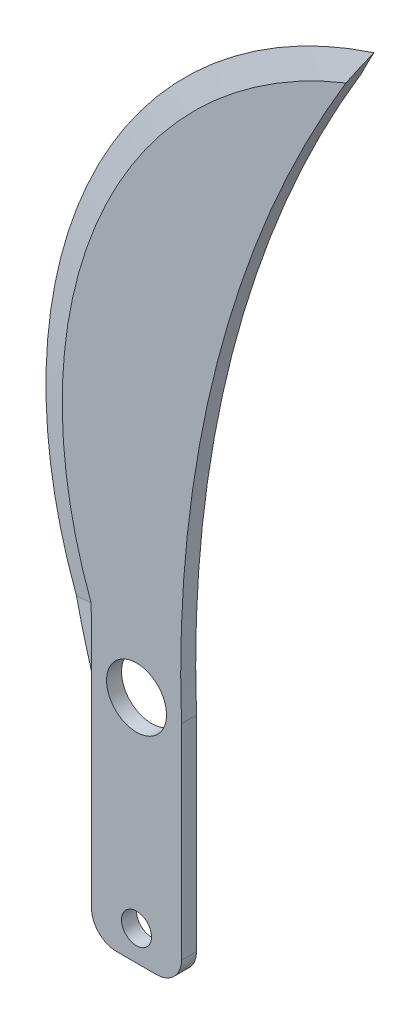
ISO-10303-21;
HEADER;
FILE_DESCRIPTION(('STEP AP214'),'2;1');
FILE_NAME('part.step','',(''),(''),'','','');
FILE_SCHEMA(('AUTOMOTIVE_DESIGN { 1 0 10303 214 1 1 1 1 }'));
ENDSEC;
DATA;
#1=APPLICATION_CONTEXT('core data for automotive mechanical design processes');
#2=APPLICATION_PROTOCOL_DEFINITION('international standard','automotive_design',2000,#1);
#3=PRODUCT_CONTEXT('',#1,'mechanical');
#4=PRODUCT('Part','Part','',(#3));
#5=PRODUCT_RELATED_PRODUCT_CATEGORY('part','',(#4));
#6=PRODUCT_DEFINITION_FORMATION('','',#4);
#7=PRODUCT_DEFINITION_CONTEXT('part definition',#1,'design');
#8=PRODUCT_DEFINITION('design','',#6,#7);
#9=PRODUCT_DEFINITION_SHAPE('','',#8);
#10=(LENGTH_UNIT() NAMED_UNIT(*) SI_UNIT(.MILLI.,.METRE.));
#11=(NAMED_UNIT(*) PLANE_ANGLE_UNIT() SI_UNIT($,.RADIAN.));
#12=(NAMED_UNIT(*) SI_UNIT($,.STERADIAN.) SOLID_ANGLE_UNIT());
#13=UNCERTAINTY_MEASURE_WITH_UNIT(LENGTH_MEASURE(1.E-05),#10,'distance_accuracy_value','');
#14=(GEOMETRIC_REPRESENTATION_CONTEXT(3) GLOBAL_UNCERTAINTY_ASSIGNED_CONTEXT((#13)) GLOBAL_UNIT_ASSIGNED_CONTEXT((#10,
#11,#12)) REPRESENTATION_CONTEXT('',''));
#15=CARTESIAN_POINT('',(0.,0.,0.));
#16=DIRECTION('',(0.,0.,1.));
#17=DIRECTION('',(1.,0.,0.));
#18=AXIS2_PLACEMENT_3D('',#15,#16,#17);
#19=CARTESIAN_POINT('',(84.3752402678986,43.6556849646685,3.));
#20=DIRECTION('',(0.,0.,-1.));
#21=DIRECTION('',(-1.,0.,0.));
#22=AXIS2_PLACEMENT_3D('',#19,#20,#21);
#23=PLANE('',#22);
#24=CARTESIAN_POINT('',(9.00000000000001,0.,3.));
#25=DIRECTION('',(0.,0.,1.));
#26=DIRECTION('',(1.,0.,0.));
#27=AXIS2_PLACEMENT_3D('',#24,#25,#26);
#28=CIRCLE('',#27,6.);
#29=CARTESIAN_POINT('',(15.,0.,3.));
#30=VERTEX_POINT('',#29);
#31=EDGE_CURVE('E143',#30,#30,#28,.T.);
#32=ORIENTED_EDGE('',*,*,#31,.F.);
#33=EDGE_LOOP('',(#32));
#34=FACE_BOUND('',#33,.T.);
#35=CARTESIAN_POINT('',(9.00000000000001,-40.,3.));
#36=DIRECTION('',(0.,0.,1.));
#37=DIRECTION('',(1.,0.,0.));
#38=AXIS2_PLACEMENT_3D('',#35,#36,#37);
#39=CIRCLE('',#38,3.);
#40=CARTESIAN_POINT('',(12.,-40.,3.));
#41=VERTEX_POINT('',#40);
#42=EDGE_CURVE('E149',#41,#41,#39,.T.);
#43=ORIENTED_EDGE('',*,*,#42,.F.);
#44=EDGE_LOOP('',(#43));
#45=FACE_BOUND('',#44,.T.);
#46=CARTESIAN_POINT('',(84.3752402678991,43.6556849646683,3.));
#47=DIRECTION('',(0.,0.,-1.));
#48=DIRECTION('',(-1.,0.,0.));
#49=AXIS2_PLACEMENT_3D('',#46,#47,#48);
#50=CIRCLE('',#49,90.2426077964557);
#51=CARTESIAN_POINT('',(-0.0663610561505634,11.8226168163549,3.00000000000004));
#52=VERTEX_POINT('',#51);
#53=CARTESIAN_POINT('',(50.9039327116185,127.461411692487,3.00000000000001));
#54=VERTEX_POINT('',#53);
#55=EDGE_CURVE('E137',#52,#54,#50,.T.);
#56=ORIENTED_EDGE('',*,*,#55,.F.);
#57=DIRECTION('',(0.00561297146020199,-0.999984247151617,0.));
#58=VECTOR('',#57,1.);
#59=CARTESIAN_POINT('',(-0.242375973937434,43.1807212176409,3.));
#60=LINE('',#59,#58);
#61=CARTESIAN_POINT('',(0.,0.,2.99999999999997));
#62=VERTEX_POINT('',#61);
#63=EDGE_CURVE('E351',#52,#62,#60,.T.);
#64=ORIENTED_EDGE('',*,*,#63,.T.);
#65=DIRECTION('',(0.,-1.,0.));
#66=VECTOR('',#65,1.);
#67=CARTESIAN_POINT('',(0.,0.,3.));
#68=LINE('',#67,#66);
#69=CARTESIAN_POINT('',(0.,-41.,3.));
#70=VERTEX_POINT('',#69);
#71=EDGE_CURVE('E154',#62,#70,#68,.T.);
#72=ORIENTED_EDGE('',*,*,#71,.T.);
#73=CARTESIAN_POINT('',(5.00000000000001,-41.,3.));
#74=DIRECTION('',(0.,0.,-1.));
#75=DIRECTION('',(-1.,0.,0.));
#76=AXIS2_PLACEMENT_3D('',#73,#74,#75);
#77=CIRCLE('',#76,5.);
#78=CARTESIAN_POINT('',(5.00000000000001,-46.,3.));
#79=VERTEX_POINT('',#78);
#80=EDGE_CURVE('E189',#70,#79,#77,.F.);
#81=ORIENTED_EDGE('',*,*,#80,.T.);
#82=DIRECTION('',(1.,0.,0.));
#83=VECTOR('',#82,1.);
#84=CARTESIAN_POINT('',(0.,-46.,3.));
#85=LINE('',#84,#83);
#86=CARTESIAN_POINT('',(13.,-46.,3.));
#87=VERTEX_POINT('',#86);
#88=EDGE_CURVE('E156',#79,#87,#85,.T.);
#89=ORIENTED_EDGE('',*,*,#88,.T.);
#90=CARTESIAN_POINT('',(13.,-41.,3.));
#91=DIRECTION('',(0.,0.,-1.));
#92=DIRECTION('',(-1.,0.,0.));
#93=AXIS2_PLACEMENT_3D('',#90,#91,#92);
#94=CIRCLE('',#93,5.);
#95=CARTESIAN_POINT('',(18.,-41.,3.));
#96=VERTEX_POINT('',#95);
#97=EDGE_CURVE('E191',#87,#96,#94,.F.);
#98=ORIENTED_EDGE('',*,*,#97,.T.);
#99=DIRECTION('',(0.,1.,0.));
#100=VECTOR('',#99,1.);
#101=CARTESIAN_POINT('',(18.,-46.,3.));
#102=LINE('',#101,#100);
#103=CARTESIAN_POINT('',(18.,0.,3.));
#104=VERTEX_POINT('',#103);
#105=EDGE_CURVE('E160',#96,#104,#102,.T.);
#106=ORIENTED_EDGE('',*,*,#105,.T.);
#107=CARTESIAN_POINT('',(247.837449271123,8.64562967886917,3.));
#108=DIRECTION('',(0.,0.,-1.));
#109=DIRECTION('',(-1.,0.,0.));
#110=AXIS2_PLACEMENT_3D('',#107,#108,#109);
#111=CIRCLE('',#110,230.);
#112=EDGE_CURVE('E162',#104,#54,#111,.T.);
#113=ORIENTED_EDGE('',*,*,#112,.T.);
#114=EDGE_LOOP('',(#56,#64,#72,#81,#89,#98,#106,#113));
#115=FACE_BOUND('',#114,.T.);
#116=ADVANCED_FACE('F37',(#34,#45,#115),#23,.F.);
#117=CARTESIAN_POINT('',(84.3752402678986,43.6556849646685,0.));
#118=DIRECTION('',(0.,0.,-1.));
#119=DIRECTION('',(-1.,0.,0.));
#120=AXIS2_PLACEMENT_3D('',#117,#118,#119);
#121=PLANE('',#120);
#122=DIRECTION('',(0.00561297146020199,-0.999984247151617,0.));
#123=VECTOR('',#122,1.);
#124=CARTESIAN_POINT('',(-0.24237597393735,43.1807212176409,0.));
#125=LINE('',#124,#123);
#126=CARTESIAN_POINT('',(-0.0663610561506111,11.8226168163549,0.));
#127=VERTEX_POINT('',#126);
#128=CARTESIAN_POINT('',(0.,0.,0.));
#129=VERTEX_POINT('',#128);
#130=EDGE_CURVE('E117',#127,#129,#125,.T.);
#131=ORIENTED_EDGE('',*,*,#130,.F.);
#132=CARTESIAN_POINT('',(84.3752402678991,43.6556849646683,0.));
#133=DIRECTION('',(0.,0.,-1.));
#134=DIRECTION('',(-1.,0.,0.));
#135=AXIS2_PLACEMENT_3D('',#132,#133,#134);
#136=CIRCLE('',#135,90.2426077964557);
#137=CARTESIAN_POINT('',(50.9039327116184,127.461411692487,0.));
#138=VERTEX_POINT('',#137);
#139=EDGE_CURVE('E129',#127,#138,#136,.T.);
#140=ORIENTED_EDGE('',*,*,#139,.T.);
#141=CARTESIAN_POINT('',(247.837449271123,8.64562967886917,0.));
#142=DIRECTION('',(0.,0.,-1.));
#143=DIRECTION('',(-1.,0.,0.));
#144=AXIS2_PLACEMENT_3D('',#141,#142,#143);
#145=CIRCLE('',#144,230.);
#146=CARTESIAN_POINT('',(18.,0.,0.));
#147=VERTEX_POINT('',#146);
#148=EDGE_CURVE('E157',#147,#138,#145,.T.);
#149=ORIENTED_EDGE('',*,*,#148,.F.);
#150=DIRECTION('',(0.,1.,0.));
#151=VECTOR('',#150,1.);
#152=CARTESIAN_POINT('',(18.,-46.,0.));
#153=LINE('',#152,#151);
#154=CARTESIAN_POINT('',(18.,-41.,0.));
#155=VERTEX_POINT('',#154);
#156=EDGE_CURVE('E170',#155,#147,#153,.T.);
#157=ORIENTED_EDGE('',*,*,#156,.F.);
#158=CARTESIAN_POINT('',(13.,-41.,0.));
#159=DIRECTION('',(0.,0.,-1.));
#160=DIRECTION('',(-1.,0.,0.));
#161=AXIS2_PLACEMENT_3D('',#158,#159,#160);
#162=CIRCLE('',#161,5.);
#163=CARTESIAN_POINT('',(13.,-46.,0.));
#164=VERTEX_POINT('',#163);
#165=EDGE_CURVE('E182',#155,#164,#162,.T.);
#166=ORIENTED_EDGE('',*,*,#165,.T.);
#167=DIRECTION('',(1.,0.,0.));
#168=VECTOR('',#167,1.);
#169=CARTESIAN_POINT('',(0.,-46.,0.));
#170=LINE('',#169,#168);
#171=CARTESIAN_POINT('',(5.00000000000001,-46.,0.));
#172=VERTEX_POINT('',#171);
#173=EDGE_CURVE('E167',#172,#164,#170,.T.);
#174=ORIENTED_EDGE('',*,*,#173,.F.);
#175=CARTESIAN_POINT('',(5.00000000000001,-41.,0.));
#176=DIRECTION('',(0.,0.,-1.));
#177=DIRECTION('',(-1.,0.,0.));
#178=AXIS2_PLACEMENT_3D('',#175,#176,#177);
#179=CIRCLE('',#178,5.);
#180=CARTESIAN_POINT('',(0.,-41.,0.));
#181=VERTEX_POINT('',#180);
#182=EDGE_CURVE('E180',#172,#181,#179,.T.);
#183=ORIENTED_EDGE('',*,*,#182,.T.);
#184=DIRECTION('',(0.,-1.,0.));
#185=VECTOR('',#184,1.);
#186=CARTESIAN_POINT('',(0.,0.,0.));
#187=LINE('',#186,#185);
#188=EDGE_CURVE('E131',#129,#181,#187,.T.);
#189=ORIENTED_EDGE('',*,*,#188,.F.);
#190=EDGE_LOOP('',(#131,#140,#149,#157,#166,#174,#183,#189));
#191=FACE_BOUND('',#190,.T.);
#192=CARTESIAN_POINT('',(9.00000000000001,0.,0.));
#193=DIRECTION('',(0.,0.,1.));
#194=DIRECTION('',(1.,0.,0.));
#195=AXIS2_PLACEMENT_3D('',#192,#193,#194);
#196=CIRCLE('',#195,6.);
#197=CARTESIAN_POINT('',(15.,0.,0.));
#198=VERTEX_POINT('',#197);
#199=EDGE_CURVE('E139',#198,#198,#196,.T.);
#200=ORIENTED_EDGE('',*,*,#199,.T.);
#201=EDGE_LOOP('',(#200));
#202=FACE_BOUND('',#201,.T.);
#203=CARTESIAN_POINT('',(9.00000000000001,-40.,0.));
#204=DIRECTION('',(0.,0.,1.));
#205=DIRECTION('',(1.,0.,0.));
#206=AXIS2_PLACEMENT_3D('',#203,#204,#205);
#207=CIRCLE('',#206,3.);
#208=CARTESIAN_POINT('',(12.,-40.,0.));
#209=VERTEX_POINT('',#208);
#210=EDGE_CURVE('E146',#209,#209,#207,.T.);
#211=ORIENTED_EDGE('',*,*,#210,.T.);
#212=EDGE_LOOP('',(#211));
#213=FACE_BOUND('',#212,.T.);
#214=ADVANCED_FACE('F126',(#191,#202,#213),#121,.T.);
#215=CARTESIAN_POINT('',(247.837449271123,8.64562967886917,3.));
#216=DIRECTION('',(0.,0.,-1.));
#217=DIRECTION('',(-1.,0.,0.));
#218=AXIS2_PLACEMENT_3D('',#215,#216,#217);
#219=CYLINDRICAL_SURFACE('',#218,230.);
#220=CARTESIAN_POINT('',(50.9033897890699,127.460511810357,3.0002));
#221=CARTESIAN_POINT('',(51.2358756029935,128.011602573172,2.87771946986628));
#222=CARTESIAN_POINT('',(51.5706081501082,128.561187468945,2.7545632880961));
#223=CARTESIAN_POINT('',(52.2445182214452,129.657278642901,2.50696815882581));
#224=CARTESIAN_POINT('',(52.5836954262588,130.203785138318,2.38252930363875));
#225=CARTESIAN_POINT('',(53.2664936888209,131.293731141773,2.13241990196135));
#226=CARTESIAN_POINT('',(53.6101147443586,131.837170651337,2.00674935608372));
#227=CARTESIAN_POINT('',(54.3018010623346,132.920994008971,1.75422348395903));
#228=CARTESIAN_POINT('',(54.6498666406828,133.461377635849,1.62736807366763));
#229=CARTESIAN_POINT('',(55.0001300105484,134.0002,1.49995270588161));
#230=B_SPLINE_CURVE_WITH_KNOTS('',3,(#220,#221,#222,#223,#224,#225,#226,#227,#228,#229),
.UNSPECIFIED.,.F.,.F.,(4,2,2,2,4),(0.,1.96550748643787,3.93087449094219,5.89624051778801,
7.86174702619601),.UNSPECIFIED.);
#231=CARTESIAN_POINT('',(55.,134.,1.49999999999998));
#232=VERTEX_POINT('',#231);
#233=EDGE_CURVE('E11',#54,#232,#230,.T.);
#234=ORIENTED_EDGE('',*,*,#233,.F.);
#235=ORIENTED_EDGE('',*,*,#112,.F.);
#236=DIRECTION('',(0.,0.,-1.));
#237=VECTOR('',#236,1.);
#238=CARTESIAN_POINT('',(18.,0.,3.));
#239=LINE('',#238,#237);
#240=EDGE_CURVE('E165',#104,#147,#239,.T.);
#241=ORIENTED_EDGE('',*,*,#240,.T.);
#242=ORIENTED_EDGE('',*,*,#148,.T.);
#243=CARTESIAN_POINT('',(55.0001300105483,134.0002,1.50004729411839));
#244=CARTESIAN_POINT('',(54.6498666406828,133.461377635849,1.37263192633237));
#245=CARTESIAN_POINT('',(54.3018010623346,132.920994008971,1.24577651604097));
#246=CARTESIAN_POINT('',(53.6101147443586,131.837170651337,0.993250643916279));
#247=CARTESIAN_POINT('',(53.2664936888209,131.293731141773,0.867580098038656));
#248=CARTESIAN_POINT('',(52.5836954262588,130.203785138318,0.617470696361248));
#249=CARTESIAN_POINT('',(52.2445182214452,129.657278642902,0.49303184117419));
#250=CARTESIAN_POINT('',(51.5706081501082,128.561187468945,0.245436711903903));
#251=CARTESIAN_POINT('',(51.2358756029935,128.011602573172,0.122280530133724));
#252=CARTESIAN_POINT('',(50.9033897890699,127.460511810357,-0.00020000000000293));
#253=B_SPLINE_CURVE_WITH_KNOTS('',3,(#243,#244,#245,#246,#247,#248,#249,#250,#251,#252),
.UNSPECIFIED.,.F.,.F.,(4,2,2,2,4),(0.,1.965506508408,3.9308725352538,5.89623953975811,
7.86174702619601),.UNSPECIFIED.);
#254=EDGE_CURVE('E50',#232,#138,#253,.T.);
#255=ORIENTED_EDGE('',*,*,#254,.F.);
#256=EDGE_LOOP('',(#234,#235,#241,#242,#255));
#257=FACE_BOUND('',#256,.T.);
#258=ADVANCED_FACE('F197',(#257),#219,.F.);
#259=CARTESIAN_POINT('',(84.3752402678986,43.6556849646685,3.));
#260=DIRECTION('',(0.,0.,-1.));
#261=DIRECTION('',(-1.,0.,0.));
#262=AXIS2_PLACEMENT_3D('',#259,#260,#261);
#263=CYLINDRICAL_SURFACE('',#262,95.);
#264=CARTESIAN_POINT('',(84.3752402678986,43.6556849646685,31.453384943504));
#265=DIRECTION('',(0.31871241509084,0.00178895187100452,-0.947849775079452));
#266=DIRECTION('',(-0.947834843745656,-0.00532025373607984,-0.318717435798283));
#267=AXIS2_PLACEMENT_3D('',#264,#265,#266);
#268=ELLIPSE('',#267,100.226852923014,95.);
#269=CARTESIAN_POINT('',(-4.51793693148397,10.1444473360881,1.5));
#270=VERTEX_POINT('',#269);
#271=EDGE_CURVE('E133',#62,#270,#268,.T.);
#272=ORIENTED_EDGE('',*,*,#271,.T.);
#273=CARTESIAN_POINT('',(84.3752402678986,43.6556849646685,-28.4533849435034));
#274=DIRECTION('',(0.318712415090834,0.00178895187100449,0.947849775079454));
#275=DIRECTION('',(0.947834843745658,0.00532025373607985,-0.318717435798277));
#276=AXIS2_PLACEMENT_3D('',#273,#274,#275);
#277=ELLIPSE('',#276,100.226852923014,95.);
#278=EDGE_CURVE('E119',#270,#129,#277,.T.);
#279=ORIENTED_EDGE('',*,*,#278,.T.);
#280=DIRECTION('',(0.,0.,-1.));
#281=VECTOR('',#280,1.);
#282=CARTESIAN_POINT('',(0.,0.,3.));
#283=LINE('',#282,#281);
#284=EDGE_CURVE('E175',#62,#129,#283,.T.);
#285=ORIENTED_EDGE('',*,*,#284,.F.);
#286=EDGE_LOOP('',(#272,#279,#285));
#287=FACE_BOUND('',#286,.T.);
#288=ADVANCED_FACE('F223',(#287),#263,.T.);
#289=CARTESIAN_POINT('',(0.,0.,3.));
#290=DIRECTION('',(1.,0.,0.));
#291=DIRECTION('',(0.,1.,0.));
#292=AXIS2_PLACEMENT_3D('',#289,#290,#291);
#293=PLANE('',#292);
#294=ORIENTED_EDGE('',*,*,#188,.T.);
#295=DIRECTION('',(0.,0.,-1.));
#296=VECTOR('',#295,1.);
#297=CARTESIAN_POINT('',(0.,-41.,3.));
#298=LINE('',#297,#296);
#299=EDGE_CURVE('E64',#181,#70,#298,.F.);
#300=ORIENTED_EDGE('',*,*,#299,.T.);
#301=ORIENTED_EDGE('',*,*,#71,.F.);
#302=ORIENTED_EDGE('',*,*,#284,.T.);
#303=EDGE_LOOP('',(#294,#300,#301,#302));
#304=FACE_BOUND('',#303,.T.);
#305=ADVANCED_FACE('F228',(#304),#293,.F.);
#306=CARTESIAN_POINT('',(0.,-46.,3.));
#307=DIRECTION('',(0.,1.,0.));
#308=DIRECTION('',(0.,0.,1.));
#309=AXIS2_PLACEMENT_3D('',#306,#307,#308);
#310=PLANE('',#309);
#311=ORIENTED_EDGE('',*,*,#173,.T.);
#312=DIRECTION('',(0.,0.,-1.));
#313=VECTOR('',#312,1.);
#314=CARTESIAN_POINT('',(13.,-46.,3.));
#315=LINE('',#314,#313);
#316=EDGE_CURVE('E187',#164,#87,#315,.F.);
#317=ORIENTED_EDGE('',*,*,#316,.T.);
#318=ORIENTED_EDGE('',*,*,#88,.F.);
#319=DIRECTION('',(0.,0.,-1.));
#320=VECTOR('',#319,1.);
#321=CARTESIAN_POINT('',(5.00000000000001,-46.,3.));
#322=LINE('',#321,#320);
#323=EDGE_CURVE('E184',#79,#172,#322,.T.);
#324=ORIENTED_EDGE('',*,*,#323,.T.);
#325=EDGE_LOOP('',(#311,#317,#318,#324));
#326=FACE_BOUND('',#325,.T.);
#327=ADVANCED_FACE('F247',(#326),#310,.F.);
#328=CARTESIAN_POINT('',(18.,-46.,3.));
#329=DIRECTION('',(-1.,0.,0.));
#330=DIRECTION('',(0.,-1.,0.));
#331=AXIS2_PLACEMENT_3D('',#328,#329,#330);
#332=PLANE('',#331);
#333=ORIENTED_EDGE('',*,*,#105,.F.);
#334=DIRECTION('',(0.,0.,-1.));
#335=VECTOR('',#334,1.);
#336=CARTESIAN_POINT('',(18.,-41.,3.));
#337=LINE('',#336,#335);
#338=EDGE_CURVE('E177',#96,#155,#337,.T.);
#339=ORIENTED_EDGE('',*,*,#338,.T.);
#340=ORIENTED_EDGE('',*,*,#156,.T.);
#341=ORIENTED_EDGE('',*,*,#240,.F.);
#342=EDGE_LOOP('',(#333,#339,#340,#341));
#343=FACE_BOUND('',#342,.T.);
#344=ADVANCED_FACE('F215',(#343),#332,.F.);
#345=CARTESIAN_POINT('',(9.00000000000001,-40.,3.));
#346=DIRECTION('',(0.,0.,-1.));
#347=DIRECTION('',(-1.,0.,0.));
#348=AXIS2_PLACEMENT_3D('',#345,#346,#347);
#349=CYLINDRICAL_SURFACE('',#348,3.);
#350=ORIENTED_EDGE('',*,*,#42,.T.);
#351=EDGE_LOOP('',(#350));
#352=FACE_BOUND('',#351,.T.);
#353=ORIENTED_EDGE('',*,*,#210,.F.);
#354=EDGE_LOOP('',(#353));
#355=FACE_BOUND('',#354,.T.);
#356=ADVANCED_FACE('F211',(#352,#355),#349,.F.);
#357=CARTESIAN_POINT('',(9.00000000000001,0.,3.));
#358=DIRECTION('',(0.,0.,-1.));
#359=DIRECTION('',(-1.,0.,0.));
#360=AXIS2_PLACEMENT_3D('',#357,#358,#359);
#361=CYLINDRICAL_SURFACE('',#360,6.);
#362=ORIENTED_EDGE('',*,*,#31,.T.);
#363=EDGE_LOOP('',(#362));
#364=FACE_BOUND('',#363,.T.);
#365=ORIENTED_EDGE('',*,*,#199,.F.);
#366=EDGE_LOOP('',(#365));
#367=FACE_BOUND('',#366,.T.);
#368=ADVANCED_FACE('F207',(#364,#367),#361,.F.);
#369=CARTESIAN_POINT('',(13.,-41.,3.));
#370=DIRECTION('',(0.,0.,-1.));
#371=DIRECTION('',(-1.,0.,0.));
#372=AXIS2_PLACEMENT_3D('',#369,#370,#371);
#373=CYLINDRICAL_SURFACE('',#372,5.);
#374=ORIENTED_EDGE('',*,*,#97,.F.);
#375=ORIENTED_EDGE('',*,*,#316,.F.);
#376=ORIENTED_EDGE('',*,*,#165,.F.);
#377=ORIENTED_EDGE('',*,*,#338,.F.);
#378=EDGE_LOOP('',(#374,#375,#376,#377));
#379=FACE_BOUND('',#378,.T.);
#380=ADVANCED_FACE('F210',(#379),#373,.T.);
#381=CARTESIAN_POINT('',(5.00000000000001,-41.,3.));
#382=DIRECTION('',(0.,0.,-1.));
#383=DIRECTION('',(-1.,0.,0.));
#384=AXIS2_PLACEMENT_3D('',#381,#382,#383);
#385=CYLINDRICAL_SURFACE('',#384,5.);
#386=ORIENTED_EDGE('',*,*,#80,.F.);
#387=ORIENTED_EDGE('',*,*,#299,.F.);
#388=ORIENTED_EDGE('',*,*,#182,.F.);
#389=ORIENTED_EDGE('',*,*,#323,.F.);
#390=EDGE_LOOP('',(#386,#387,#388,#389));
#391=FACE_BOUND('',#390,.T.);
#392=ADVANCED_FACE('F39',(#391),#385,.T.);
#393=CARTESIAN_POINT('',(84.3752402678991,43.6556849646683,1.5));
#394=DIRECTION('',(0.,0.,-1.));
#395=DIRECTION('',(-1.,0.,0.));
#396=AXIS2_PLACEMENT_3D('',#393,#394,#395);
#397=CONICAL_SURFACE('',#396,95.0000000000005,1.26536370769589);
#398=ORIENTED_EDGE('',*,*,#55,.T.);
#399=ORIENTED_EDGE('',*,*,#233,.T.);
#400=CARTESIAN_POINT('',(84.3752402678991,43.6556849646683,1.5));
#401=DIRECTION('',(0.,0.,-1.));
#402=DIRECTION('',(-1.,0.,0.));
#403=AXIS2_PLACEMENT_3D('',#400,#401,#402);
#404=CIRCLE('',#403,95.0000000000005);
#405=EDGE_CURVE('E57',#270,#232,#404,.T.);
#406=ORIENTED_EDGE('',*,*,#405,.F.);
#407=DIRECTION('',(0.892409788430707,0.336423530178191,0.300705799504273));
#408=VECTOR('',#407,1.);
#409=CARTESIAN_POINT('',(-4.51793693148397,10.1444473360881,1.5));
#410=LINE('',#409,#408);
#411=EDGE_CURVE('E121',#270,#52,#410,.T.);
#412=ORIENTED_EDGE('',*,*,#411,.T.);
#413=EDGE_LOOP('',(#398,#399,#406,#412));
#414=FACE_BOUND('',#413,.T.);
#415=ADVANCED_FACE('F204',(#414),#397,.T.);
#416=CARTESIAN_POINT('',(84.3752402678991,43.6556849646683,-0.806867016721682));
#417=DIRECTION('',(0.,0.,1.));
#418=DIRECTION('',(1.,0.,0.));
#419=AXIS2_PLACEMENT_3D('',#416,#417,#418);
#420=CONICAL_SURFACE('',#419,87.6835525600228,1.26536370769589);
#421=DIRECTION('',(-0.892409788430707,-0.336423530178191,0.300705799504273));
#422=VECTOR('',#421,1.);
#423=CARTESIAN_POINT('',(-4.51793693148397,10.1444473360881,1.5));
#424=LINE('',#423,#422);
#425=EDGE_CURVE('E114',#127,#270,#424,.T.);
#426=ORIENTED_EDGE('',*,*,#425,.T.);
#427=ORIENTED_EDGE('',*,*,#405,.T.);
#428=ORIENTED_EDGE('',*,*,#254,.T.);
#429=ORIENTED_EDGE('',*,*,#139,.F.);
#430=EDGE_LOOP('',(#426,#427,#428,#429));
#431=FACE_BOUND('',#430,.T.);
#432=ADVANCED_FACE('F135',(#431),#420,.T.);
#433=CARTESIAN_POINT('',(-4.45157587533321,-1.67816948026669,1.5));
#434=DIRECTION('',(0.318712415090834,0.00178895187100449,0.947849775079454));
#435=DIRECTION('',(0.947851291808038,0.,-0.318712925087505));
#436=AXIS2_PLACEMENT_3D('',#433,#434,#435);
#437=PLANE('',#436);
#438=ORIENTED_EDGE('',*,*,#130,.T.);
#439=ORIENTED_EDGE('',*,*,#278,.F.);
#440=ORIENTED_EDGE('',*,*,#425,.F.);
#441=EDGE_LOOP('',(#438,#439,#440));
#442=FACE_BOUND('',#441,.T.);
#443=ADVANCED_FACE('F116',(#442),#437,.F.);
#444=CARTESIAN_POINT('',(-4.45157587533321,-1.67816948026669,1.5));
#445=DIRECTION('',(0.31871241509084,0.00178895187100452,-0.947849775079452));
#446=DIRECTION('',(-0.947851291808036,0.,-0.318712925087511));
#447=AXIS2_PLACEMENT_3D('',#444,#445,#446);
#448=PLANE('',#447);
#449=ORIENTED_EDGE('',*,*,#411,.F.);
#450=ORIENTED_EDGE('',*,*,#271,.F.);
#451=ORIENTED_EDGE('',*,*,#63,.F.);
#452=EDGE_LOOP('',(#449,#450,#451));
#453=FACE_BOUND('',#452,.T.);
#454=ADVANCED_FACE('F332',(#453),#448,.F.);
#455=CLOSED_SHELL('',(#116,#214,#258,#288,#305,#327,#344,#356,#368,#380,#392,#415,#432,#443,#454));
#456=MANIFOLD_SOLID_BREP('B2',#455);
#457=ADVANCED_BREP_SHAPE_REPRESENTATION('',(#18,#456),#14);
#458=SHAPE_DEFINITION_REPRESENTATION(#9,#457);
ENDSEC;
END-ISO-10303-21;
